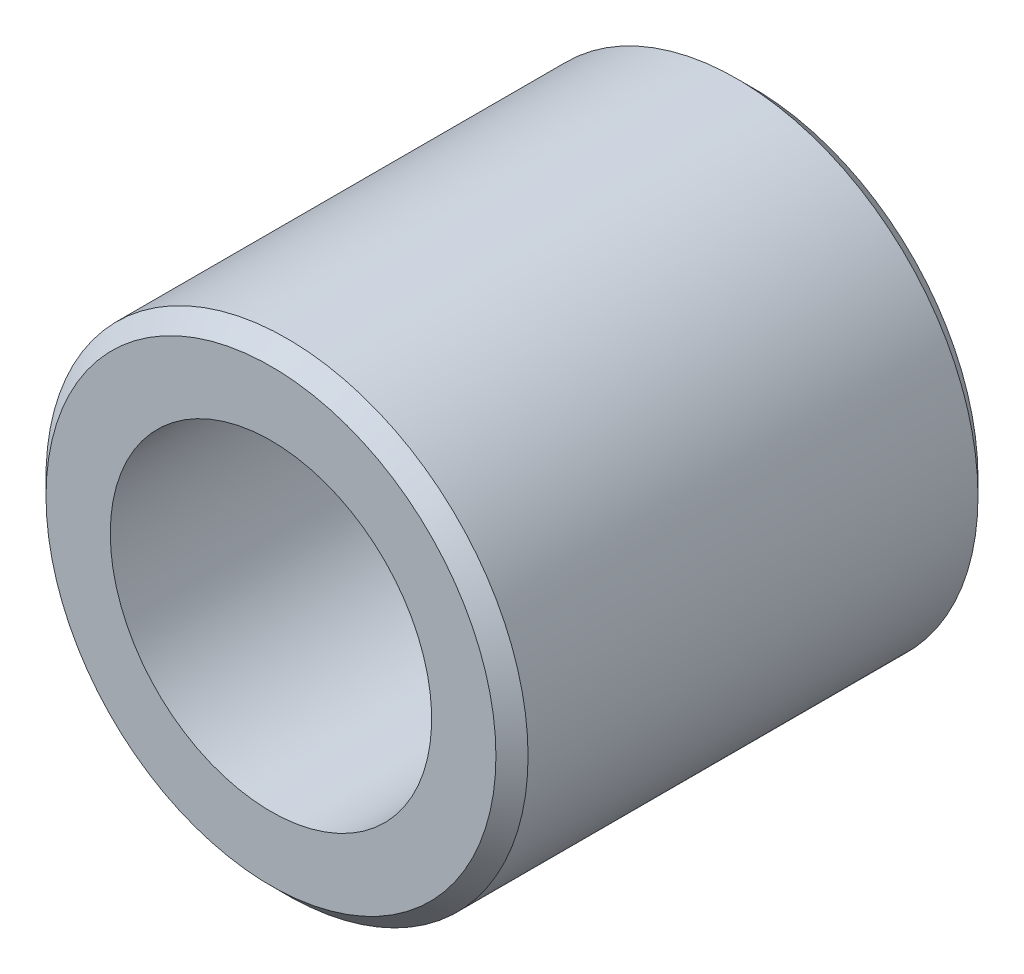
ISO-10303-21;
HEADER;
FILE_DESCRIPTION(('STEP AP214'),'2;1');
FILE_NAME('part.step','',(''),(''),'','','');
FILE_SCHEMA(('AUTOMOTIVE_DESIGN { 1 0 10303 214 1 1 1 1 }'));
ENDSEC;
DATA;
#1=APPLICATION_CONTEXT('core data for automotive mechanical design processes');
#2=APPLICATION_PROTOCOL_DEFINITION('international standard','automotive_design',2000,#1);
#3=PRODUCT_CONTEXT('',#1,'mechanical');
#4=PRODUCT('Part','Part','',(#3));
#5=PRODUCT_RELATED_PRODUCT_CATEGORY('part','',(#4));
#6=PRODUCT_DEFINITION_FORMATION('','',#4);
#7=PRODUCT_DEFINITION_CONTEXT('part definition',#1,'design');
#8=PRODUCT_DEFINITION('design','',#6,#7);
#9=PRODUCT_DEFINITION_SHAPE('','',#8);
#10=(LENGTH_UNIT() NAMED_UNIT(*) SI_UNIT(.MILLI.,.METRE.));
#11=(NAMED_UNIT(*) PLANE_ANGLE_UNIT() SI_UNIT($,.RADIAN.));
#12=(NAMED_UNIT(*) SI_UNIT($,.STERADIAN.) SOLID_ANGLE_UNIT());
#13=UNCERTAINTY_MEASURE_WITH_UNIT(LENGTH_MEASURE(1.E-05),#10,'distance_accuracy_value','');
#14=(GEOMETRIC_REPRESENTATION_CONTEXT(3) GLOBAL_UNCERTAINTY_ASSIGNED_CONTEXT((#13)) GLOBAL_UNIT_ASSIGNED_CONTEXT((#10,
#11,#12)) REPRESENTATION_CONTEXT('',''));
#15=CARTESIAN_POINT('',(0.,0.,0.));
#16=DIRECTION('',(0.,0.,1.));
#17=DIRECTION('',(1.,0.,0.));
#18=AXIS2_PLACEMENT_3D('',#15,#16,#17);
#19=CARTESIAN_POINT('',(0.,0.,30.));
#20=DIRECTION('',(0.,0.,-1.));
#21=DIRECTION('',(-1.,0.,0.));
#22=AXIS2_PLACEMENT_3D('',#19,#20,#21);
#23=CYLINDRICAL_SURFACE('',#22,15.);
#24=CARTESIAN_POINT('',(0.,0.,29.));
#25=DIRECTION('',(0.,0.,1.));
#26=DIRECTION('',(1.,0.,0.));
#27=AXIS2_PLACEMENT_3D('',#24,#25,#26);
#28=CIRCLE('',#27,15.);
#29=CARTESIAN_POINT('',(15.,0.,29.));
#30=VERTEX_POINT('',#29);
#31=EDGE_CURVE('E52',#30,#30,#28,.F.);
#32=ORIENTED_EDGE('',*,*,#31,.T.);
#33=EDGE_LOOP('',(#32));
#34=FACE_BOUND('',#33,.T.);
#35=CARTESIAN_POINT('',(0.,0.,1.00000000000001));
#36=DIRECTION('',(0.,0.,1.));
#37=DIRECTION('',(1.,0.,0.));
#38=AXIS2_PLACEMENT_3D('',#35,#36,#37);
#39=CIRCLE('',#38,15.);
#40=CARTESIAN_POINT('',(15.,0.,1.00000000000001));
#41=VERTEX_POINT('',#40);
#42=EDGE_CURVE('E57',#41,#41,#39,.T.);
#43=ORIENTED_EDGE('',*,*,#42,.T.);
#44=EDGE_LOOP('',(#43));
#45=FACE_BOUND('',#44,.T.);
#46=ADVANCED_FACE('F43',(#34,#45),#23,.T.);
#47=CARTESIAN_POINT('',(0.,0.,30.));
#48=DIRECTION('',(0.,0.,1.));
#49=DIRECTION('',(1.,0.,0.));
#50=AXIS2_PLACEMENT_3D('',#47,#48,#49);
#51=PLANE('',#50);
#52=CARTESIAN_POINT('',(0.,0.,30.));
#53=DIRECTION('',(0.,0.,1.));
#54=DIRECTION('',(1.,0.,0.));
#55=AXIS2_PLACEMENT_3D('',#52,#53,#54);
#56=CIRCLE('',#55,14.);
#57=CARTESIAN_POINT('',(14.,0.,30.));
#58=VERTEX_POINT('',#57);
#59=EDGE_CURVE('E62',#58,#58,#56,.T.);
#60=ORIENTED_EDGE('',*,*,#59,.T.);
#61=EDGE_LOOP('',(#60));
#62=FACE_BOUND('',#61,.T.);
#63=CARTESIAN_POINT('',(0.,0.,30.));
#64=DIRECTION('',(0.,0.,-1.));
#65=DIRECTION('',(-1.,0.,0.));
#66=AXIS2_PLACEMENT_3D('',#63,#64,#65);
#67=CIRCLE('',#66,10.);
#68=CARTESIAN_POINT('',(-10.,0.,30.));
#69=VERTEX_POINT('',#68);
#70=EDGE_CURVE('E68',#69,#69,#67,.T.);
#71=ORIENTED_EDGE('',*,*,#70,.T.);
#72=EDGE_LOOP('',(#71));
#73=FACE_BOUND('',#72,.T.);
#74=ADVANCED_FACE('F77',(#62,#73),#51,.T.);
#75=CARTESIAN_POINT('',(0.,0.,0.));
#76=DIRECTION('',(0.,0.,1.));
#77=DIRECTION('',(1.,0.,0.));
#78=AXIS2_PLACEMENT_3D('',#75,#76,#77);
#79=PLANE('',#78);
#80=CARTESIAN_POINT('',(0.,0.,0.));
#81=DIRECTION('',(0.,0.,1.));
#82=DIRECTION('',(1.,0.,0.));
#83=AXIS2_PLACEMENT_3D('',#80,#81,#82);
#84=CIRCLE('',#83,14.);
#85=CARTESIAN_POINT('',(14.,0.,0.));
#86=VERTEX_POINT('',#85);
#87=EDGE_CURVE('E10',#86,#86,#84,.F.);
#88=ORIENTED_EDGE('',*,*,#87,.T.);
#89=EDGE_LOOP('',(#88));
#90=FACE_BOUND('',#89,.T.);
#91=CARTESIAN_POINT('',(0.,0.,0.));
#92=DIRECTION('',(0.,0.,-1.));
#93=DIRECTION('',(-1.,0.,0.));
#94=AXIS2_PLACEMENT_3D('',#91,#92,#93);
#95=CIRCLE('',#94,10.);
#96=CARTESIAN_POINT('',(-10.,0.,0.));
#97=VERTEX_POINT('',#96);
#98=EDGE_CURVE('E69',#97,#97,#95,.T.);
#99=ORIENTED_EDGE('',*,*,#98,.F.);
#100=EDGE_LOOP('',(#99));
#101=FACE_BOUND('',#100,.T.);
#102=ADVANCED_FACE('F83',(#90,#101),#79,.F.);
#103=CARTESIAN_POINT('',(0.,0.,30.));
#104=DIRECTION('',(0.,0.,-1.));
#105=DIRECTION('',(-1.,0.,0.));
#106=AXIS2_PLACEMENT_3D('',#103,#104,#105);
#107=CYLINDRICAL_SURFACE('',#106,10.);
#108=ORIENTED_EDGE('',*,*,#70,.F.);
#109=EDGE_LOOP('',(#108));
#110=FACE_BOUND('',#109,.T.);
#111=ORIENTED_EDGE('',*,*,#98,.T.);
#112=EDGE_LOOP('',(#111));
#113=FACE_BOUND('',#112,.T.);
#114=ADVANCED_FACE('F79',(#110,#113),#107,.F.);
#115=CARTESIAN_POINT('',(0.,0.,30.));
#116=DIRECTION('',(0.,0.,-1.));
#117=DIRECTION('',(-1.,0.,0.));
#118=AXIS2_PLACEMENT_3D('',#115,#116,#117);
#119=CONICAL_SURFACE('',#118,14.,0.785398163397447);
#120=ORIENTED_EDGE('',*,*,#31,.F.);
#121=EDGE_LOOP('',(#120));
#122=FACE_BOUND('',#121,.T.);
#123=ORIENTED_EDGE('',*,*,#59,.F.);
#124=EDGE_LOOP('',(#123));
#125=FACE_BOUND('',#124,.T.);
#126=ADVANCED_FACE('F82',(#122,#125),#119,.T.);
#127=CARTESIAN_POINT('',(0.,0.,1.00000000000001));
#128=DIRECTION('',(0.,0.,1.));
#129=DIRECTION('',(1.,0.,0.));
#130=AXIS2_PLACEMENT_3D('',#127,#128,#129);
#131=CONICAL_SURFACE('',#130,15.,0.785398163397451);
#132=ORIENTED_EDGE('',*,*,#87,.F.);
#133=EDGE_LOOP('',(#132));
#134=FACE_BOUND('',#133,.T.);
#135=ORIENTED_EDGE('',*,*,#42,.F.);
#136=EDGE_LOOP('',(#135));
#137=FACE_BOUND('',#136,.T.);
#138=ADVANCED_FACE('F46',(#134,#137),#131,.T.);
#139=CLOSED_SHELL('',(#46,#74,#102,#114,#126,#138));
#140=MANIFOLD_SOLID_BREP('B2',#139);
#141=ADVANCED_BREP_SHAPE_REPRESENTATION('',(#18,#140),#14);
#142=SHAPE_DEFINITION_REPRESENTATION(#9,#141);
ENDSEC;
END-ISO-10303-21;
